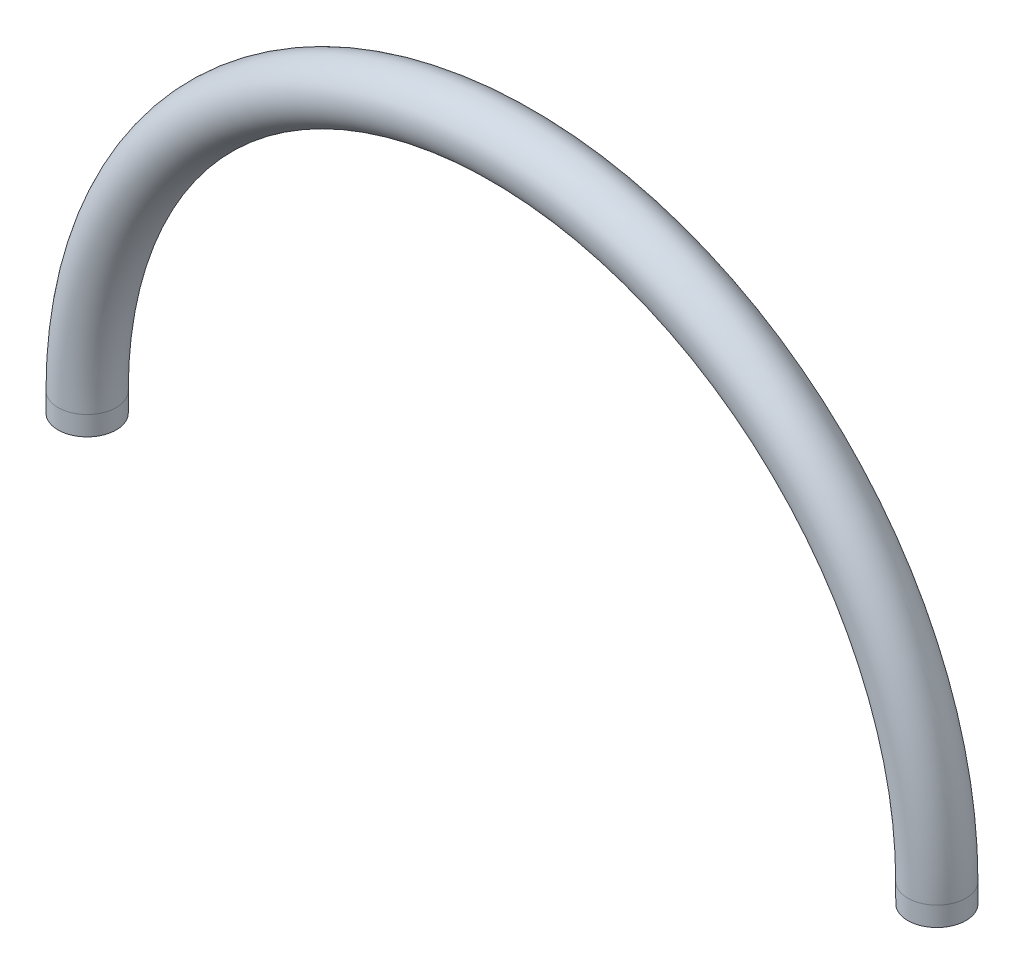
ISO-10303-21;
HEADER;
FILE_DESCRIPTION(('STEP AP214'),'2;1');
FILE_NAME('part.step','',(''),(''),'','','');
FILE_SCHEMA(('AUTOMOTIVE_DESIGN { 1 0 10303 214 1 1 1 1 }'));
ENDSEC;
DATA;
#1=APPLICATION_CONTEXT('core data for automotive mechanical design processes');
#2=APPLICATION_PROTOCOL_DEFINITION('international standard','automotive_design',2000,#1);
#3=PRODUCT_CONTEXT('',#1,'mechanical');
#4=PRODUCT('Part','Part','',(#3));
#5=PRODUCT_RELATED_PRODUCT_CATEGORY('part','',(#4));
#6=PRODUCT_DEFINITION_FORMATION('','',#4);
#7=PRODUCT_DEFINITION_CONTEXT('part definition',#1,'design');
#8=PRODUCT_DEFINITION('design','',#6,#7);
#9=PRODUCT_DEFINITION_SHAPE('','',#8);
#10=(LENGTH_UNIT() NAMED_UNIT(*) SI_UNIT(.MILLI.,.METRE.));
#11=(NAMED_UNIT(*) PLANE_ANGLE_UNIT() SI_UNIT($,.RADIAN.));
#12=(NAMED_UNIT(*) SI_UNIT($,.STERADIAN.) SOLID_ANGLE_UNIT());
#13=UNCERTAINTY_MEASURE_WITH_UNIT(LENGTH_MEASURE(1.E-05),#10,'distance_accuracy_value','');
#14=(GEOMETRIC_REPRESENTATION_CONTEXT(3) GLOBAL_UNCERTAINTY_ASSIGNED_CONTEXT((#13)) GLOBAL_UNIT_ASSIGNED_CONTEXT((#10,
#11,#12)) REPRESENTATION_CONTEXT('',''));
#15=CARTESIAN_POINT('',(0.,0.,0.));
#16=DIRECTION('',(0.,0.,1.));
#17=DIRECTION('',(1.,0.,0.));
#18=AXIS2_PLACEMENT_3D('',#15,#16,#17);
#19=CARTESIAN_POINT('',(-55.626,-2.54000000000001,0.));
#20=DIRECTION('',(0.,-1.,0.));
#21=DIRECTION('',(0.,0.,1.));
#22=AXIS2_PLACEMENT_3D('',#19,#20,#21);
#23=PLANE('',#22);
#24=CARTESIAN_POINT('',(-55.626,-2.54000000000001,0.));
#25=DIRECTION('',(0.,-1.,0.));
#26=DIRECTION('',(0.,0.,1.));
#27=AXIS2_PLACEMENT_3D('',#24,#25,#26);
#28=CIRCLE('',#27,3.81);
#29=CARTESIAN_POINT('',(-55.626,-2.54000000000001,3.81));
#30=VERTEX_POINT('',#29);
#31=EDGE_CURVE('E63',#30,#30,#28,.T.);
#32=ORIENTED_EDGE('',*,*,#31,.T.);
#33=EDGE_LOOP('',(#32));
#34=FACE_BOUND('',#33,.T.);
#35=ADVANCED_FACE('F49',(#34),#23,.T.);
#36=CARTESIAN_POINT('',(55.626,-2.53999999999999,0.));
#37=DIRECTION('',(0.,1.,0.));
#38=DIRECTION('',(0.,0.,1.));
#39=AXIS2_PLACEMENT_3D('',#36,#37,#38);
#40=PLANE('',#39);
#41=CARTESIAN_POINT('',(55.626,-2.53999999999999,0.));
#42=DIRECTION('',(0.,1.,0.));
#43=DIRECTION('',(0.,0.,1.));
#44=AXIS2_PLACEMENT_3D('',#41,#42,#43);
#45=CIRCLE('',#44,3.81);
#46=CARTESIAN_POINT('',(55.626,-2.53999999999999,3.81));
#47=VERTEX_POINT('',#46);
#48=EDGE_CURVE('E11',#47,#47,#45,.T.);
#49=ORIENTED_EDGE('',*,*,#48,.F.);
#50=EDGE_LOOP('',(#49));
#51=FACE_BOUND('',#50,.T.);
#52=ADVANCED_FACE('F73',(#51),#40,.F.);
#53=CARTESIAN_POINT('',(-55.626,-2.54000000000001,0.));
#54=DIRECTION('',(0.,1.,0.));
#55=DIRECTION('',(-1.,0.,0.));
#56=AXIS2_PLACEMENT_3D('',#53,#54,#55);
#57=CYLINDRICAL_SURFACE('',#56,3.81);
#58=CARTESIAN_POINT('',(-55.626,0.,0.));
#59=DIRECTION('',(0.,-1.,0.));
#60=DIRECTION('',(0.,0.,1.));
#61=AXIS2_PLACEMENT_3D('',#58,#59,#60);
#62=CIRCLE('',#61,3.81);
#63=CARTESIAN_POINT('',(-59.436,0.,0.));
#64=VERTEX_POINT('',#63);
#65=EDGE_CURVE('E59',#64,#64,#62,.T.);
#66=ORIENTED_EDGE('',*,*,#65,.T.);
#67=EDGE_LOOP('',(#66));
#68=FACE_BOUND('',#67,.T.);
#69=ORIENTED_EDGE('',*,*,#31,.F.);
#70=EDGE_LOOP('',(#69));
#71=FACE_BOUND('',#70,.T.);
#72=ADVANCED_FACE('F70',(#68,#71),#57,.T.);
#73=CARTESIAN_POINT('',(0.,0.,0.));
#74=DIRECTION('',(0.,0.,-1.));
#75=DIRECTION('',(-1.,0.,0.));
#76=AXIS2_PLACEMENT_3D('',#73,#74,#75);
#77=TOROIDAL_SURFACE('',#76,55.626,3.81);
#78=CARTESIAN_POINT('',(55.626,1.51788304147971E-13,0.));
#79=DIRECTION('',(0.,1.,0.));
#80=DIRECTION('',(0.,0.,1.));
#81=AXIS2_PLACEMENT_3D('',#78,#79,#80);
#82=CIRCLE('',#81,3.81);
#83=CARTESIAN_POINT('',(59.436,1.62184763336188E-13,0.));
#84=VERTEX_POINT('',#83);
#85=EDGE_CURVE('E55',#84,#84,#82,.T.);
#86=CARTESIAN_POINT('',(0.,0.,0.));
#87=DIRECTION('',(0.,0.,-1.));
#88=DIRECTION('',(-1.,0.,0.));
#89=AXIS2_PLACEMENT_3D('',#86,#87,#88);
#90=CIRCLE('',#89,59.436);
#91=EDGE_CURVE('',#64,#84,#90,.T.);
#92=ORIENTED_EDGE('',*,*,#65,.F.);
#93=ORIENTED_EDGE('',*,*,#85,.T.);
#94=ORIENTED_EDGE('',*,*,#91,.T.);
#95=ORIENTED_EDGE('',*,*,#91,.F.);
#96=EDGE_LOOP('',(#92,#94,#93,#95));
#97=FACE_BOUND('',#96,.T.);
#98=ADVANCED_FACE('F72',(#97),#77,.T.);
#99=CARTESIAN_POINT('',(55.626,0.,0.));
#100=DIRECTION('',(0.,-1.,0.));
#101=DIRECTION('',(1.,0.,0.));
#102=AXIS2_PLACEMENT_3D('',#99,#100,#101);
#103=CYLINDRICAL_SURFACE('',#102,3.81);
#104=ORIENTED_EDGE('',*,*,#48,.T.);
#105=EDGE_LOOP('',(#104));
#106=FACE_BOUND('',#105,.T.);
#107=ORIENTED_EDGE('',*,*,#85,.F.);
#108=EDGE_LOOP('',(#107));
#109=FACE_BOUND('',#108,.T.);
#110=ADVANCED_FACE('F80',(#106,#109),#103,.T.);
#111=CLOSED_SHELL('',(#35,#52,#72,#98,#110));
#112=MANIFOLD_SOLID_BREP('B2',#111);
#113=ADVANCED_BREP_SHAPE_REPRESENTATION('',(#18,#112),#14);
#114=SHAPE_DEFINITION_REPRESENTATION(#9,#113);
ENDSEC;
END-ISO-10303-21;
